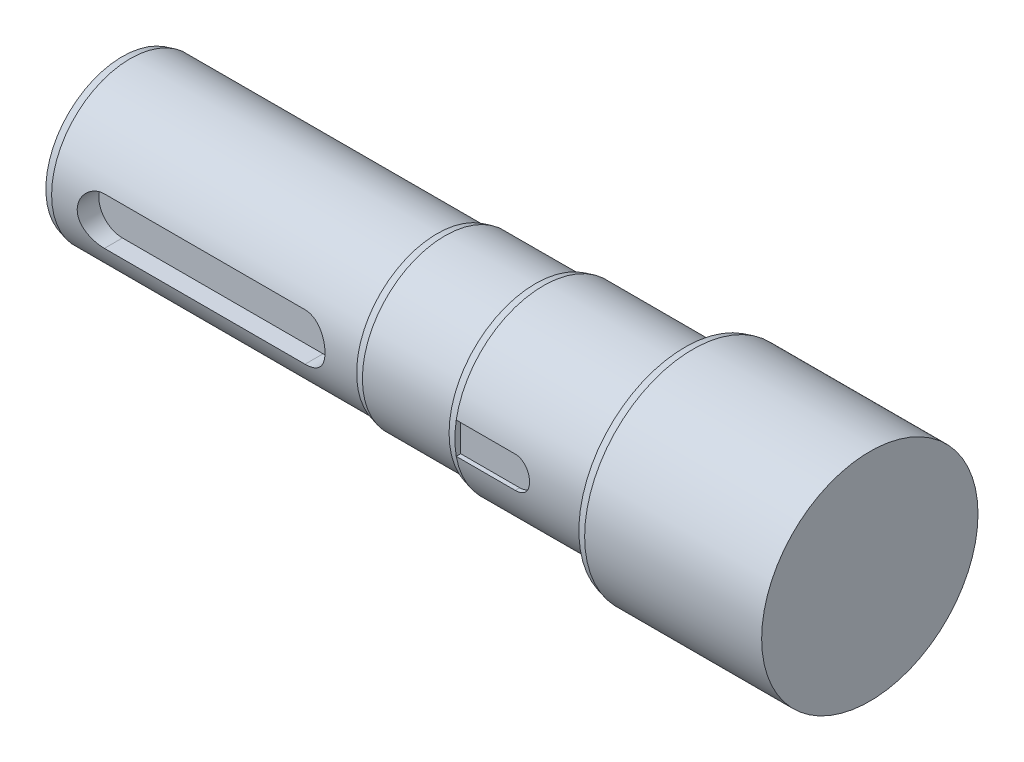
ISO-10303-21;
HEADER;
FILE_DESCRIPTION(('STEP AP214'),'2;1');
FILE_NAME('part.step','',(''),(''),'','','');
FILE_SCHEMA(('AUTOMOTIVE_DESIGN { 1 0 10303 214 1 1 1 1 }'));
ENDSEC;
DATA;
#1=APPLICATION_CONTEXT('core data for automotive mechanical design processes');
#2=APPLICATION_PROTOCOL_DEFINITION('international standard','automotive_design',2000,#1);
#3=PRODUCT_CONTEXT('',#1,'mechanical');
#4=PRODUCT('Part','Part','',(#3));
#5=PRODUCT_RELATED_PRODUCT_CATEGORY('part','',(#4));
#6=PRODUCT_DEFINITION_FORMATION('','',#4);
#7=PRODUCT_DEFINITION_CONTEXT('part definition',#1,'design');
#8=PRODUCT_DEFINITION('design','',#6,#7);
#9=PRODUCT_DEFINITION_SHAPE('','',#8);
#10=(LENGTH_UNIT() NAMED_UNIT(*) SI_UNIT(.MILLI.,.METRE.));
#11=(NAMED_UNIT(*) PLANE_ANGLE_UNIT() SI_UNIT($,.RADIAN.));
#12=(NAMED_UNIT(*) SI_UNIT($,.STERADIAN.) SOLID_ANGLE_UNIT());
#13=UNCERTAINTY_MEASURE_WITH_UNIT(LENGTH_MEASURE(1.E-05),#10,'distance_accuracy_value','');
#14=(GEOMETRIC_REPRESENTATION_CONTEXT(3) GLOBAL_UNCERTAINTY_ASSIGNED_CONTEXT((#13)) GLOBAL_UNIT_ASSIGNED_CONTEXT((#10,
#11,#12)) REPRESENTATION_CONTEXT('',''));
#15=CARTESIAN_POINT('',(0.,0.,0.));
#16=DIRECTION('',(0.,0.,1.));
#17=DIRECTION('',(1.,0.,0.));
#18=AXIS2_PLACEMENT_3D('',#15,#16,#17);
#19=CARTESIAN_POINT('',(-47.,27.5,0.));
#20=DIRECTION('',(1.,0.,0.));
#21=DIRECTION('',(0.,0.,-1.));
#22=AXIS2_PLACEMENT_3D('',#19,#20,#21);
#23=PLANE('',#22);
#24=CARTESIAN_POINT('',(-47.,0.,0.));
#25=DIRECTION('',(1.,0.,0.));
#26=DIRECTION('',(0.,0.,-1.));
#27=AXIS2_PLACEMENT_3D('',#24,#25,#26);
#28=CIRCLE('',#27,26.9641016151378);
#29=CARTESIAN_POINT('',(-47.,0.,-26.9641016151378));
#30=VERTEX_POINT('',#29);
#31=EDGE_CURVE('E204',#30,#30,#28,.F.);
#32=ORIENTED_EDGE('',*,*,#31,.T.);
#33=EDGE_LOOP('',(#32));
#34=FACE_BOUND('',#33,.T.);
#35=CARTESIAN_POINT('',(-47.,0.,0.));
#36=DIRECTION('',(-1.,0.,0.));
#37=DIRECTION('',(0.,0.,1.));
#38=AXIS2_PLACEMENT_3D('',#35,#36,#37);
#39=CIRCLE('',#38,22.5);
#40=CARTESIAN_POINT('',(-47.,0.,22.5));
#41=VERTEX_POINT('',#40);
#42=EDGE_CURVE('E195',#41,#41,#39,.T.);
#43=ORIENTED_EDGE('',*,*,#42,.F.);
#44=EDGE_LOOP('',(#43));
#45=FACE_BOUND('',#44,.T.);
#46=ADVANCED_FACE('F39',(#34,#45),#23,.F.);
#47=CARTESIAN_POINT('',(-55.0769282450954,0.,0.));
#48=DIRECTION('',(-1.,0.,0.));
#49=DIRECTION('',(0.,0.,1.));
#50=AXIS2_PLACEMENT_3D('',#47,#48,#49);
#51=CYLINDRICAL_SURFACE('',#50,27.5);
#52=CARTESIAN_POINT('',(-45.0000000000002,0.,0.));
#53=DIRECTION('',(1.,0.,0.));
#54=DIRECTION('',(0.,0.,-1.));
#55=AXIS2_PLACEMENT_3D('',#52,#53,#54);
#56=CIRCLE('',#55,27.5);
#57=CARTESIAN_POINT('',(-45.0000000000002,0.,-27.5));
#58=VERTEX_POINT('',#57);
#59=EDGE_CURVE('E207',#58,#58,#56,.T.);
#60=ORIENTED_EDGE('',*,*,#59,.T.);
#61=EDGE_LOOP('',(#60));
#62=FACE_BOUND('',#61,.T.);
#63=CARTESIAN_POINT('',(0.,0.,0.));
#64=DIRECTION('',(-1.,0.,0.));
#65=DIRECTION('',(0.,0.,1.));
#66=AXIS2_PLACEMENT_3D('',#63,#64,#65);
#67=CIRCLE('',#66,27.5);
#68=CARTESIAN_POINT('',(0.,0.,27.5));
#69=VERTEX_POINT('',#68);
#70=EDGE_CURVE('E192',#69,#69,#67,.T.);
#71=ORIENTED_EDGE('',*,*,#70,.T.);
#72=EDGE_LOOP('',(#71));
#73=FACE_BOUND('',#72,.T.);
#74=ADVANCED_FACE('F271',(#62,#73),#51,.T.);
#75=CARTESIAN_POINT('',(0.,0.,0.));
#76=DIRECTION('',(-1.,0.,0.));
#77=DIRECTION('',(0.,0.,1.));
#78=AXIS2_PLACEMENT_3D('',#75,#76,#77);
#79=PLANE('',#78);
#80=ORIENTED_EDGE('',*,*,#70,.F.);
#81=EDGE_LOOP('',(#80));
#82=FACE_BOUND('',#81,.T.);
#83=ADVANCED_FACE('F277',(#82),#79,.F.);
#84=CARTESIAN_POINT('',(-190.,20.,0.));
#85=DIRECTION('',(1.,0.,0.));
#86=DIRECTION('',(0.,0.,-1.));
#87=AXIS2_PLACEMENT_3D('',#84,#85,#86);
#88=PLANE('',#87);
#89=CARTESIAN_POINT('',(-190.,0.,0.));
#90=DIRECTION('',(1.,0.,0.));
#91=DIRECTION('',(0.,0.,-1.));
#92=AXIS2_PLACEMENT_3D('',#89,#90,#91);
#93=CIRCLE('',#92,19.4641016151377);
#94=CARTESIAN_POINT('',(-190.,0.,-19.4641016151377));
#95=VERTEX_POINT('',#94);
#96=EDGE_CURVE('E346',#95,#95,#93,.F.);
#97=ORIENTED_EDGE('',*,*,#96,.T.);
#98=EDGE_LOOP('',(#97));
#99=FACE_BOUND('',#98,.T.);
#100=CARTESIAN_POINT('',(-190.,10.,0.));
#101=DIRECTION('',(-1.,0.,0.));
#102=DIRECTION('',(0.,0.,1.));
#103=AXIS2_PLACEMENT_3D('',#100,#101,#102);
#104=CIRCLE('',#103,3.4);
#105=CARTESIAN_POINT('',(-190.,10.,3.4));
#106=VERTEX_POINT('',#105);
#107=EDGE_CURVE('E152',#106,#106,#104,.T.);
#108=ORIENTED_EDGE('',*,*,#107,.F.);
#109=EDGE_LOOP('',(#108));
#110=FACE_BOUND('',#109,.T.);
#111=CARTESIAN_POINT('',(-190.,-10.,0.));
#112=DIRECTION('',(-1.,0.,0.));
#113=DIRECTION('',(0.,0.,1.));
#114=AXIS2_PLACEMENT_3D('',#111,#112,#113);
#115=CIRCLE('',#114,3.4);
#116=CARTESIAN_POINT('',(-190.,-10.,3.4));
#117=VERTEX_POINT('',#116);
#118=EDGE_CURVE('E158',#117,#117,#115,.T.);
#119=ORIENTED_EDGE('',*,*,#118,.F.);
#120=EDGE_LOOP('',(#119));
#121=FACE_BOUND('',#120,.T.);
#122=ADVANCED_FACE('F267',(#99,#110,#121),#88,.F.);
#123=CARTESIAN_POINT('',(-55.0769282450954,0.,0.));
#124=DIRECTION('',(-1.,0.,0.));
#125=DIRECTION('',(0.,0.,1.));
#126=AXIS2_PLACEMENT_3D('',#123,#124,#125);
#127=CYLINDRICAL_SURFACE('',#126,20.);
#128=CARTESIAN_POINT('',(-188.,0.,0.));
#129=DIRECTION('',(1.,0.,0.));
#130=DIRECTION('',(0.,0.,-1.));
#131=AXIS2_PLACEMENT_3D('',#128,#129,#130);
#132=CIRCLE('',#131,20.);
#133=CARTESIAN_POINT('',(-188.,0.,-20.));
#134=VERTEX_POINT('',#133);
#135=EDGE_CURVE('E52',#134,#134,#132,.T.);
#136=ORIENTED_EDGE('',*,*,#135,.T.);
#137=EDGE_LOOP('',(#136));
#138=FACE_BOUND('',#137,.T.);
#139=DIRECTION('',(-1.,0.,0.));
#140=VECTOR('',#139,1.);
#141=CARTESIAN_POINT('',(-55.0769282450954,6.,19.0787840283389));
#142=LINE('',#141,#140);
#143=CARTESIAN_POINT('',(-175.5,6.,19.0787840283389));
#144=VERTEX_POINT('',#143);
#145=CARTESIAN_POINT('',(-124.5,6.,19.0787840283389));
#146=VERTEX_POINT('',#145);
#147=EDGE_CURVE('E344',#144,#146,#142,.F.);
#148=ORIENTED_EDGE('',*,*,#147,.T.);
#149=CARTESIAN_POINT('',(-124.5,6.,19.0787840283389));
#150=CARTESIAN_POINT('',(-124.335332005089,6.00002230630953,19.0787603919218));
#151=CARTESIAN_POINT('',(-124.17067261307,5.99322212828861,19.0809150948053));
#152=CARTESIAN_POINT('',(-123.842610571615,5.96614198358438,19.089408588524));
#153=CARTESIAN_POINT('',(-123.679207647986,5.94586504749982,19.0957464386677));
#154=CARTESIAN_POINT('',(-123.355233206316,5.89206455668659,19.1124126760414));
#155=CARTESIAN_POINT('',(-123.194655572036,5.85857463708937,19.1227309292375));
#156=CARTESIAN_POINT('',(-122.877037691332,5.77865096251378,19.1470349488515));
#157=CARTESIAN_POINT('',(-122.719997537531,5.73221686903431,19.1610208111801));
#158=CARTESIAN_POINT('',(-122.410617439276,5.62682620459484,19.1922338155173));
#159=CARTESIAN_POINT('',(-122.258274781224,5.56787702452553,19.2094590438082));
#160=CARTESIAN_POINT('',(-121.959125857098,5.43788252899624,19.2466621419291));
#161=CARTESIAN_POINT('',(-121.812321675672,5.36683271334057,19.2666410353108));
#162=CARTESIAN_POINT('',(-121.525215054747,5.21317247195195,19.3087849542851));
#163=CARTESIAN_POINT('',(-121.38491298147,5.13056139609833,19.3309501027959));
#164=CARTESIAN_POINT('',(-121.111612201325,4.95431913401973,19.3768680311909));
#165=CARTESIAN_POINT('',(-120.978616283128,4.86068378223771,19.4006214097184));
#166=CARTESIAN_POINT('',(-120.71713642677,4.66024014290223,19.4497584548899));
#167=CARTESIAN_POINT('',(-120.588884847802,4.5531352636269,19.4751691904069));
#168=CARTESIAN_POINT('',(-120.341746062991,4.32860344600267,19.5263015189751));
#169=CARTESIAN_POINT('',(-120.222862133329,4.21117292654719,19.5520232171847));
#170=CARTESIAN_POINT('',(-119.995258604878,3.96676059198592,19.6030710031715));
#171=CARTESIAN_POINT('',(-119.886539067971,3.83977871873939,19.6283970885393));
#172=CARTESIAN_POINT('',(-119.679980745528,3.57705696576212,19.6779706962222));
#173=CARTESIAN_POINT('',(-119.582141874161,3.4413171551297,19.7022182270443));
#174=CARTESIAN_POINT('',(-119.39609023174,3.15899953964078,19.7494715734221));
#175=CARTESIAN_POINT('',(-119.308121953698,3.01225429870655,19.7724407517412));
#176=CARTESIAN_POINT('',(-119.144936205945,2.71155717798054,19.8159158974823));
#177=CARTESIAN_POINT('',(-119.069714021433,2.55760798995098,19.8364227748921));
#178=CARTESIAN_POINT('',(-118.932583560629,2.24348996032483,19.8744001644265));
#179=CARTESIAN_POINT('',(-118.870677745232,2.0833199755562,19.8918701152059));
#180=CARTESIAN_POINT('',(-118.760762497544,1.75801430484774,19.923254535561));
#181=CARTESIAN_POINT('',(-118.712747060032,1.5928807989739,19.9371705413065));
#182=CARTESIAN_POINT('',(-118.632174453272,1.26354510595576,19.960709769643));
#183=CARTESIAN_POINT('',(-118.599219373042,1.0994480892508,19.9704430293701));
#184=CARTESIAN_POINT('',(-118.547128002714,0.768952154148964,19.9858966495547));
#185=CARTESIAN_POINT('',(-118.527986195865,0.60255418179931,19.9916186120195));
#186=CARTESIAN_POINT('',(-118.503680035143,0.268644299740245,19.9988929276978));
#187=CARTESIAN_POINT('',(-118.498516105694,0.101132356360991,20.0004451543012));
#188=CARTESIAN_POINT('',(-118.502216405078,-0.233720900410844,19.9993350985708));
#189=CARTESIAN_POINT('',(-118.511080376463,-0.401062216878487,19.9966728935831));
#190=CARTESIAN_POINT('',(-118.542242211602,-0.728949940400293,19.9873626800314));
#191=CARTESIAN_POINT('',(-118.564100009983,-0.889542117296638,19.9808452710305));
#192=CARTESIAN_POINT('',(-118.620695481758,-1.20830021014904,19.9641050678088));
#193=CARTESIAN_POINT('',(-118.655437542225,-1.36646528055413,19.9538810115069));
#194=CARTESIAN_POINT('',(-118.73749230161,-1.67917461818936,19.9300014175933));
#195=CARTESIAN_POINT('',(-118.784800775723,-1.8337200833573,19.9163470333349));
#196=CARTESIAN_POINT('',(-118.891630271063,-2.13828018933733,19.885954581515));
#197=CARTESIAN_POINT('',(-118.951155883997,-2.28829310223868,19.8692153547842));
#198=CARTESIAN_POINT('',(-119.082690579539,-2.5844350788094,19.8328818557961));
#199=CARTESIAN_POINT('',(-119.154832897198,-2.73050124822118,19.8132575095082));
#200=CARTESIAN_POINT('',(-119.310623147329,-3.01609632375419,19.7717979578185));
#201=CARTESIAN_POINT('',(-119.394275028384,-3.15562296424239,19.7499619943591));
#202=CARTESIAN_POINT('',(-119.572486982441,-3.42724384686889,19.704643118031));
#203=CARTESIAN_POINT('',(-119.667047181428,-3.55933800314025,19.681160186142));
#204=CARTESIAN_POINT('',(-119.866458678429,-3.81531376455354,19.6331439703208));
#205=CARTESIAN_POINT('',(-119.971310276501,-3.93919513006482,19.6086106557752));
#206=CARTESIAN_POINT('',(-120.194897243463,-4.1826365359165,19.5581593507452));
#207=CARTESIAN_POINT('',(-120.314012679474,-4.30184428600932,19.5322244988475));
#208=CARTESIAN_POINT('',(-120.561833503502,-4.52981041510265,19.4806179410542));
#209=CARTESIAN_POINT('',(-120.690535796081,-4.63857214120814,19.454946153239));
#210=CARTESIAN_POINT('',(-120.956840396238,-4.84504126060964,19.4045581786367));
#211=CARTESIAN_POINT('',(-121.094448571901,-4.94274124635231,19.3798426394128));
#212=CARTESIAN_POINT('',(-121.377559092333,-5.12628631686322,19.3321023379674));
#213=CARTESIAN_POINT('',(-121.523058337578,-5.21213600998875,19.3090769201297));
#214=CARTESIAN_POINT('',(-121.822635135093,-5.37223080367564,19.2651525602885));
#215=CARTESIAN_POINT('',(-121.976787078659,-5.446343714374,19.2442786555291));
#216=CARTESIAN_POINT('',(-122.291121841361,-5.58122691640502,19.2055937237889));
#217=CARTESIAN_POINT('',(-122.451302162478,-5.64200266456202,19.1877814448102));
#218=CARTESIAN_POINT('',(-122.77643211835,-5.7496614534963,19.1557967477957));
#219=CARTESIAN_POINT('',(-122.941376526563,-5.79655912825486,19.1416204978023));
#220=CARTESIAN_POINT('',(-123.274893180451,-5.87609462586437,19.1173543231182));
#221=CARTESIAN_POINT('',(-123.443463715048,-5.90873902604376,19.1072625137754));
#222=CARTESIAN_POINT('',(-123.759937070236,-5.956031317324,19.0925703406668));
#223=CARTESIAN_POINT('',(-123.90754170936,-5.97251971262424,19.0874107715083));
#224=CARTESIAN_POINT('',(-124.203427112475,-5.99450261914155,19.0805126306352));
#225=CARTESIAN_POINT('',(-124.351706559575,-6.00001329545507,19.0787690288453));
#226=CARTESIAN_POINT('',(-124.5,-5.99999999999999,19.0787840283389));
#227=B_SPLINE_CURVE_WITH_KNOTS('',3,(#149,#150,#151,#152,#153,#154,#155,#156,#157,#158,#159,
#160,#161,#162,#163,#164,#165,#166,#167,#168,#169,#170,#171,#172,#173,#174,#175,#176,#177,#178,
#179,#180,#181,#182,#183,#184,#185,#186,#187,#188,#189,#190,#191,#192,#193,#194,#195,#196,#197,
#198,#199,#200,#201,#202,#203,#204,#205,#206,#207,#208,#209,#210,#211,#212,#213,#214,#215,#216,
#217,#218,#219,#220,#221,#222,#223,#224,#225,#226),.UNSPECIFIED.,.F.,.F.,(4,2,2,2,2,2,2,2,2,2,2,
2,2,2,2,2,2,2,2,2,2,2,2,2,2,2,2,2,2,2,2,2,2,2,2,2,2,2,4),(0.,0.493836284878934,
0.987561555412173,1.48003801924601,1.97252736296404,2.4647266679518,2.95710942192586,
3.44951987503681,3.94211698773,4.4485789847459,4.95521732942465,5.46185875834844,
5.96849619046392,6.48574341264192,7.00279888450883,7.51994982748058,8.03687685551442,
8.53921958328376,9.04136157401787,9.54351881163818,10.0456668334346,10.5317065218739,
11.0179118582603,11.5039539397551,11.9901790315928,12.4818885441265,12.9737671698834,
13.4656514771114,13.9575501300996,14.4684682486942,14.9792221093922,15.4903160010786,
16.001210574562,16.517502934493,17.0335836608614,17.549118241575,18.0644146711719,
18.509813123396,18.9545552237083),.UNSPECIFIED.);
#228=CARTESIAN_POINT('',(-124.5,-5.99999999999999,19.0787840283389));
#229=VERTEX_POINT('',#228);
#230=EDGE_CURVE('E215',#146,#229,#227,.T.);
#231=ORIENTED_EDGE('',*,*,#230,.T.);
#232=DIRECTION('',(-1.,0.,0.));
#233=VECTOR('',#232,1.);
#234=CARTESIAN_POINT('',(-55.0769282450954,-5.99999999999998,19.0787840283389));
#235=LINE('',#234,#233);
#236=CARTESIAN_POINT('',(-175.5,-5.99999999999998,19.0787840283389));
#237=VERTEX_POINT('',#236);
#238=EDGE_CURVE('E341',#229,#237,#235,.T.);
#239=ORIENTED_EDGE('',*,*,#238,.T.);
#240=CARTESIAN_POINT('',(-175.5,-6.,19.0787840283389));
#241=CARTESIAN_POINT('',(-175.664667994911,-6.00002230630953,19.0787603919218));
#242=CARTESIAN_POINT('',(-175.82932738693,-5.99322212828861,19.0809150948053));
#243=CARTESIAN_POINT('',(-176.157389428385,-5.96614198358438,19.089408588524));
#244=CARTESIAN_POINT('',(-176.320792352014,-5.94586504749982,19.0957464386677));
#245=CARTESIAN_POINT('',(-176.644766793684,-5.89206455668659,19.1124126760414));
#246=CARTESIAN_POINT('',(-176.805344427964,-5.85857463708937,19.1227309292375));
#247=CARTESIAN_POINT('',(-177.122962308668,-5.77865096251378,19.1470349488515));
#248=CARTESIAN_POINT('',(-177.280002462469,-5.73221686903431,19.1610208111801));
#249=CARTESIAN_POINT('',(-177.589382560724,-5.62682620459483,19.1922338155173));
#250=CARTESIAN_POINT('',(-177.741725218776,-5.56787702452553,19.2094590438082));
#251=CARTESIAN_POINT('',(-178.040874142902,-5.43788252899625,19.2466621419291));
#252=CARTESIAN_POINT('',(-178.187678324328,-5.36683271334057,19.2666410353108));
#253=CARTESIAN_POINT('',(-178.474784945253,-5.21317247195195,19.3087849542851));
#254=CARTESIAN_POINT('',(-178.61508701853,-5.13056139609833,19.3309501027959));
#255=CARTESIAN_POINT('',(-178.888387798675,-4.95431913401974,19.3768680311909));
#256=CARTESIAN_POINT('',(-179.021383716872,-4.86068378223772,19.4006214097184));
#257=CARTESIAN_POINT('',(-179.28286357323,-4.66024014290223,19.4497584548899));
#258=CARTESIAN_POINT('',(-179.411115152198,-4.55313526362689,19.4751691904069));
#259=CARTESIAN_POINT('',(-179.658253937009,-4.32860344600265,19.5263015189751));
#260=CARTESIAN_POINT('',(-179.777137866671,-4.21117292654718,19.5520232171847));
#261=CARTESIAN_POINT('',(-180.004741395122,-3.96676059198591,19.6030710031715));
#262=CARTESIAN_POINT('',(-180.113460932029,-3.83977871873937,19.6283970885393));
#263=CARTESIAN_POINT('',(-180.320019254472,-3.57705696576209,19.6779706962222));
#264=CARTESIAN_POINT('',(-180.417858125839,-3.44131715512968,19.7022182270443));
#265=CARTESIAN_POINT('',(-180.60390976826,-3.15899953964076,19.7494715734221));
#266=CARTESIAN_POINT('',(-180.691878046302,-3.01225429870653,19.7724407517412));
#267=CARTESIAN_POINT('',(-180.855063794055,-2.71155717798051,19.8159158974823));
#268=CARTESIAN_POINT('',(-180.930285978567,-2.55760798995095,19.8364227748921));
#269=CARTESIAN_POINT('',(-181.067416439371,-2.2434899603248,19.8744001644265));
#270=CARTESIAN_POINT('',(-181.129322254768,-2.08331997555618,19.8918701152059));
#271=CARTESIAN_POINT('',(-181.239237502456,-1.75801430484772,19.923254535561));
#272=CARTESIAN_POINT('',(-181.287252939968,-1.59288079897389,19.9371705413065));
#273=CARTESIAN_POINT('',(-181.367825546728,-1.26354510595574,19.960709769643));
#274=CARTESIAN_POINT('',(-181.400780626958,-1.09944808925078,19.9704430293701));
#275=CARTESIAN_POINT('',(-181.452871997286,-0.768952154148943,19.9858966495547));
#276=CARTESIAN_POINT('',(-181.472013804135,-0.602554181799289,19.9916186120195));
#277=CARTESIAN_POINT('',(-181.496319964857,-0.268644299740224,19.9988929276978));
#278=CARTESIAN_POINT('',(-181.501483894306,-0.10113235636097,20.0004451543012));
#279=CARTESIAN_POINT('',(-181.497783594921,0.233720900410867,19.9993350985708));
#280=CARTESIAN_POINT('',(-181.488919623537,0.401062216878509,19.9966728935831));
#281=CARTESIAN_POINT('',(-181.457757788398,0.728949940400315,19.9873626800314));
#282=CARTESIAN_POINT('',(-181.435899990017,0.889542117296661,19.9808452710305));
#283=CARTESIAN_POINT('',(-181.379304518242,1.20830021014907,19.9641050678088));
#284=CARTESIAN_POINT('',(-181.344562457775,1.36646528055415,19.9538810115069));
#285=CARTESIAN_POINT('',(-181.26250769839,1.67917461818939,19.9300014175933));
#286=CARTESIAN_POINT('',(-181.215199224277,1.83372008335732,19.9163470333349));
#287=CARTESIAN_POINT('',(-181.108369728937,2.13828018933735,19.885954581515));
#288=CARTESIAN_POINT('',(-181.048844116003,2.28829310223871,19.8692153547842));
#289=CARTESIAN_POINT('',(-180.917309420461,2.58443507880942,19.8328818557961));
#290=CARTESIAN_POINT('',(-180.845167102802,2.7305012482212,19.8132575095082));
#291=CARTESIAN_POINT('',(-180.689376852671,3.0160963237542,19.7717979578185));
#292=CARTESIAN_POINT('',(-180.605724971616,3.1556229642424,19.7499619943591));
#293=CARTESIAN_POINT('',(-180.427513017559,3.42724384686891,19.704643118031));
#294=CARTESIAN_POINT('',(-180.332952818572,3.55933800314026,19.681160186142));
#295=CARTESIAN_POINT('',(-180.133541321571,3.81531376455356,19.6331439703208));
#296=CARTESIAN_POINT('',(-180.028689723499,3.93919513006484,19.6086106557752));
#297=CARTESIAN_POINT('',(-179.805102756537,4.18263653591652,19.5581593507451));
#298=CARTESIAN_POINT('',(-179.685987320526,4.30184428600933,19.5322244988474));
#299=CARTESIAN_POINT('',(-179.438166496498,4.52981041510266,19.4806179410542));
#300=CARTESIAN_POINT('',(-179.309464203919,4.63857214120815,19.454946153239));
#301=CARTESIAN_POINT('',(-179.043159603762,4.84504126060965,19.4045581786367));
#302=CARTESIAN_POINT('',(-178.905551428099,4.94274124635231,19.3798426394128));
#303=CARTESIAN_POINT('',(-178.622440907667,5.12628631686323,19.3321023379674));
#304=CARTESIAN_POINT('',(-178.476941662422,5.21213600998878,19.3090769201297));
#305=CARTESIAN_POINT('',(-178.177364864907,5.37223080367567,19.2651525602885));
#306=CARTESIAN_POINT('',(-178.023212921341,5.44634371437402,19.2442786555291));
#307=CARTESIAN_POINT('',(-177.708878158639,5.58122691640503,19.2055937237889));
#308=CARTESIAN_POINT('',(-177.548697837522,5.64200266456204,19.1877814448102));
#309=CARTESIAN_POINT('',(-177.22356788165,5.74966145349632,19.1557967477956));
#310=CARTESIAN_POINT('',(-177.058623473437,5.79655912825488,19.1416204978023));
#311=CARTESIAN_POINT('',(-176.725106819549,5.87609462586438,19.1173543231182));
#312=CARTESIAN_POINT('',(-176.556536284951,5.90873902604377,19.1072625137754));
#313=CARTESIAN_POINT('',(-176.240062929764,5.95603131732401,19.0925703406668));
#314=CARTESIAN_POINT('',(-176.09245829064,5.97251971262425,19.0874107715083));
#315=CARTESIAN_POINT('',(-175.796572887525,5.99450261914155,19.0805126306352));
#316=CARTESIAN_POINT('',(-175.648293440425,6.00001329545508,19.0787690288453));
#317=CARTESIAN_POINT('',(-175.5,6.,19.0787840283389));
#318=B_SPLINE_CURVE_WITH_KNOTS('',3,(#240,#241,#242,#243,#244,#245,#246,#247,#248,#249,#250,
#251,#252,#253,#254,#255,#256,#257,#258,#259,#260,#261,#262,#263,#264,#265,#266,#267,#268,#269,
#270,#271,#272,#273,#274,#275,#276,#277,#278,#279,#280,#281,#282,#283,#284,#285,#286,#287,#288,
#289,#290,#291,#292,#293,#294,#295,#296,#297,#298,#299,#300,#301,#302,#303,#304,#305,#306,#307,
#308,#309,#310,#311,#312,#313,#314,#315,#316,#317),.UNSPECIFIED.,.F.,.F.,(4,2,2,2,2,2,2,2,2,2,2,
2,2,2,2,2,2,2,2,2,2,2,2,2,2,2,2,2,2,2,2,2,2,2,2,2,2,2,4),(0.,0.493836284878976,
0.987561555412188,1.48003801924603,1.97252736296405,2.46472666795181,2.95710942192586,
3.44951987503682,3.94211698773,4.44857898474593,4.95521732942468,5.46185875834849,
5.96849619046396,6.48574341264194,7.00279888450885,7.5199498274806,8.03687685551445,
8.53921958328379,9.04136157401789,9.54351881163821,10.0456668334346,10.531706521874,
11.0179118582603,11.5039539397552,11.9901790315928,12.4818885441265,12.9737671698834,
13.4656514771114,13.9575501300996,14.4684682486943,14.9792221093922,15.4903160010786,
16.001210574562,16.5175029344931,17.0335836608614,17.5491182415751,18.0644146711719,
18.509813123396,18.9545552237083),.UNSPECIFIED.);
#319=EDGE_CURVE('E67',#237,#144,#318,.T.);
#320=ORIENTED_EDGE('',*,*,#319,.T.);
#321=EDGE_LOOP('',(#148,#231,#239,#320));
#322=FACE_BOUND('',#321,.T.);
#323=CARTESIAN_POINT('',(-110.,0.,0.));
#324=DIRECTION('',(-1.,0.,0.));
#325=DIRECTION('',(0.,0.,1.));
#326=AXIS2_PLACEMENT_3D('',#323,#324,#325);
#327=CIRCLE('',#326,20.);
#328=CARTESIAN_POINT('',(-110.,0.,20.));
#329=VERTEX_POINT('',#328);
#330=EDGE_CURVE('E189',#329,#329,#327,.T.);
#331=ORIENTED_EDGE('',*,*,#330,.T.);
#332=EDGE_LOOP('',(#331));
#333=FACE_BOUND('',#332,.T.);
#334=ADVANCED_FACE('F228',(#138,#322,#333),#127,.T.);
#335=CARTESIAN_POINT('',(-110.,20.,0.));
#336=DIRECTION('',(1.,0.,0.));
#337=DIRECTION('',(0.,0.,-1.));
#338=AXIS2_PLACEMENT_3D('',#335,#336,#337);
#339=PLANE('',#338);
#340=CARTESIAN_POINT('',(-110.,0.,0.));
#341=DIRECTION('',(1.,0.,0.));
#342=DIRECTION('',(0.,0.,-1.));
#343=AXIS2_PLACEMENT_3D('',#340,#341,#342);
#344=CIRCLE('',#343,20.4641016151377);
#345=CARTESIAN_POINT('',(-110.,0.,-20.4641016151377));
#346=VERTEX_POINT('',#345);
#347=EDGE_CURVE('E198',#346,#346,#344,.F.);
#348=ORIENTED_EDGE('',*,*,#347,.T.);
#349=EDGE_LOOP('',(#348));
#350=FACE_BOUND('',#349,.T.);
#351=ORIENTED_EDGE('',*,*,#330,.F.);
#352=EDGE_LOOP('',(#351));
#353=FACE_BOUND('',#352,.T.);
#354=ADVANCED_FACE('F260',(#350,#353),#339,.F.);
#355=CARTESIAN_POINT('',(-55.0769282450954,0.,0.));
#356=DIRECTION('',(-1.,0.,0.));
#357=DIRECTION('',(0.,0.,1.));
#358=AXIS2_PLACEMENT_3D('',#355,#356,#357);
#359=CYLINDRICAL_SURFACE('',#358,21.);
#360=CARTESIAN_POINT('',(-108.,0.,0.));
#361=DIRECTION('',(1.,0.,0.));
#362=DIRECTION('',(0.,0.,-1.));
#363=AXIS2_PLACEMENT_3D('',#360,#361,#362);
#364=CIRCLE('',#363,21.);
#365=CARTESIAN_POINT('',(-108.,0.,-21.));
#366=VERTEX_POINT('',#365);
#367=EDGE_CURVE('E201',#366,#366,#364,.T.);
#368=ORIENTED_EDGE('',*,*,#367,.T.);
#369=EDGE_LOOP('',(#368));
#370=FACE_BOUND('',#369,.T.);
#371=CARTESIAN_POINT('',(-85.,0.,0.));
#372=DIRECTION('',(-1.,0.,0.));
#373=DIRECTION('',(0.,0.,1.));
#374=AXIS2_PLACEMENT_3D('',#371,#372,#373);
#375=CIRCLE('',#374,21.);
#376=CARTESIAN_POINT('',(-85.,0.,21.));
#377=VERTEX_POINT('',#376);
#378=EDGE_CURVE('E179',#377,#377,#375,.T.);
#379=ORIENTED_EDGE('',*,*,#378,.T.);
#380=EDGE_LOOP('',(#379));
#381=FACE_BOUND('',#380,.T.);
#382=ADVANCED_FACE('F257',(#370,#381),#359,.T.);
#383=CARTESIAN_POINT('',(-85.,21.,0.));
#384=DIRECTION('',(1.,0.,0.));
#385=DIRECTION('',(0.,0.,-1.));
#386=AXIS2_PLACEMENT_3D('',#383,#384,#385);
#387=PLANE('',#386);
#388=CARTESIAN_POINT('',(-85.,0.,0.));
#389=DIRECTION('',(1.,0.,0.));
#390=DIRECTION('',(0.,0.,-1.));
#391=AXIS2_PLACEMENT_3D('',#388,#389,#390);
#392=CIRCLE('',#391,21.9641016151377);
#393=CARTESIAN_POINT('',(-85.,0.,-21.9641016151377));
#394=VERTEX_POINT('',#393);
#395=EDGE_CURVE('E210',#394,#394,#392,.F.);
#396=ORIENTED_EDGE('',*,*,#395,.T.);
#397=EDGE_LOOP('',(#396));
#398=FACE_BOUND('',#397,.T.);
#399=ORIENTED_EDGE('',*,*,#378,.F.);
#400=EDGE_LOOP('',(#399));
#401=FACE_BOUND('',#400,.T.);
#402=ADVANCED_FACE('F253',(#398,#401),#387,.F.);
#403=CARTESIAN_POINT('',(-55.0769282450954,0.,0.));
#404=DIRECTION('',(-1.,0.,0.));
#405=DIRECTION('',(0.,0.,1.));
#406=AXIS2_PLACEMENT_3D('',#403,#404,#405);
#407=CYLINDRICAL_SURFACE('',#406,22.5);
#408=CARTESIAN_POINT('',(-82.9999999999998,0.,0.));
#409=DIRECTION('',(1.,0.,0.));
#410=DIRECTION('',(0.,0.,-1.));
#411=AXIS2_PLACEMENT_3D('',#408,#409,#410);
#412=CIRCLE('',#411,22.5);
#413=CARTESIAN_POINT('',(-82.9999999999998,-4.00000000000001,22.1415898254845));
#414=VERTEX_POINT('',#413);
#415=CARTESIAN_POINT('',(-82.9999999999998,4.,22.1415898254845));
#416=VERTEX_POINT('',#415);
#417=EDGE_CURVE('E213',#414,#416,#412,.T.);
#418=ORIENTED_EDGE('',*,*,#417,.T.);
#419=DIRECTION('',(-1.,0.,0.));
#420=VECTOR('',#419,1.);
#421=CARTESIAN_POINT('',(-55.0769282450954,4.,22.1415898254845));
#422=LINE('',#421,#420);
#423=CARTESIAN_POINT('',(-67.9999999999998,4.,22.1415898254845));
#424=VERTEX_POINT('',#423);
#425=EDGE_CURVE('E149',#416,#424,#422,.F.);
#426=ORIENTED_EDGE('',*,*,#425,.T.);
#427=CARTESIAN_POINT('',(-67.9999999999998,4.,22.1415898254845));
#428=CARTESIAN_POINT('',(-67.8884443157555,4.00001181100801,22.1415813332223));
#429=CARTESIAN_POINT('',(-67.7768949708915,3.99533336555647,22.1424327158618));
#430=CARTESIAN_POINT('',(-67.5546120835114,3.97668753174213,22.1457923878102));
#431=CARTESIAN_POINT('',(-67.4438784546347,3.96272114141922,22.1483004990943));
#432=CARTESIAN_POINT('',(-67.2241541353541,3.92561599891462,22.1549063510913));
#433=CARTESIAN_POINT('',(-67.115161294989,3.90248964726233,22.1590019425529));
#434=CARTESIAN_POINT('',(-66.8995702936997,3.84726578985144,22.1686563609308));
#435=CARTESIAN_POINT('',(-66.7929721341574,3.81516827891658,22.1742151886914));
#436=CARTESIAN_POINT('',(-66.4778519529334,3.70572537061617,22.1928628154685));
#437=CARTESIAN_POINT('',(-66.2738474717948,3.6152029334267,22.2079278079655));
#438=CARTESIAN_POINT('',(-65.8840209139626,3.40177823127076,22.2416163441149));
#439=CARTESIAN_POINT('',(-65.6981995920981,3.27887462286084,22.2602400354031));
#440=CARTESIAN_POINT('',(-65.347821879211,3.002693725567,22.2991798442776));
#441=CARTESIAN_POINT('',(-65.1834946144048,2.84912734508846,22.3195109123207));
#442=CARTESIAN_POINT('',(-64.8827880882652,2.51659712051369,22.3594438756203));
#443=CARTESIAN_POINT('',(-64.7464131235182,2.33762937908424,22.3790456583989));
#444=CARTESIAN_POINT('',(-64.5046124509981,1.95787366266691,22.4154702394148));
#445=CARTESIAN_POINT('',(-64.3994036603579,1.75694549325078,22.4322732196682));
#446=CARTESIAN_POINT('',(-64.2243260980982,1.33992992017433,22.4610376707577));
#447=CARTESIAN_POINT('',(-64.1544527336377,1.12384449078955,22.4729997707633));
#448=CARTESIAN_POINT('',(-64.052732747904,0.685035687091517,22.4906295118969));
#449=CARTESIAN_POINT('',(-64.0204961107689,0.462405357750797,22.4963616679215));
#450=CARTESIAN_POINT('',(-63.9937506887953,0.0148218653699214,22.5011077518111));
#451=CARTESIAN_POINT('',(-63.9992398914858,-0.210131173126972,22.5001220380384));
#452=CARTESIAN_POINT('',(-64.0474899380337,-0.653292127481612,22.4915939316058));
#453=CARTESIAN_POINT('',(-64.0898299522944,-0.871547492560146,22.4841255721658));
#454=CARTESIAN_POINT('',(-64.2099159898025,-1.29780435626401,22.4635541517381));
#455=CARTESIAN_POINT('',(-64.2876629682703,-1.50580557808199,22.4504509387322));
#456=CARTESIAN_POINT('',(-64.4767640571476,-1.90688912091545,22.4199570872081));
#457=CARTESIAN_POINT('',(-64.5882894422384,-2.09988895764982,22.4025446830698));
#458=CARTESIAN_POINT('',(-64.8416615283791,-2.46458864128547,22.3653628432004));
#459=CARTESIAN_POINT('',(-64.9835099321082,-2.6362872912398,22.3455932751388));
#460=CARTESIAN_POINT('',(-65.2957705620607,-2.95597328046122,22.3055727548473));
#461=CARTESIAN_POINT('',(-65.4665468970338,-3.10360423025484,22.2853189167692));
#462=CARTESIAN_POINT('',(-65.8307958773488,-3.36825910098841,22.2468602918287));
#463=CARTESIAN_POINT('',(-66.0242749036626,-3.48527438689145,22.2286560838801));
#464=CARTESIAN_POINT('',(-66.3273821165224,-3.63526613635609,22.2044452800649));
#465=CARTESIAN_POINT('',(-66.4307341401817,-3.68105863759677,22.1968817337884));
#466=CARTESIAN_POINT('',(-66.6410032756067,-3.76375689103809,22.1830092275586));
#467=CARTESIAN_POINT('',(-66.7479189875334,-3.80066608689434,22.1766997816131));
#468=CARTESIAN_POINT('',(-66.9644382933043,-3.86527748108294,22.1655296302423));
#469=CARTESIAN_POINT('',(-67.0740389357243,-3.89298934140409,22.1606674050398));
#470=CARTESIAN_POINT('',(-67.2952071474055,-3.93903732288808,22.1525288047932));
#471=CARTESIAN_POINT('',(-67.4067737490413,-3.95737793011878,22.1492516709978));
#472=CARTESIAN_POINT('',(-67.5987699533218,-3.98063899953617,22.1450809520836));
#473=CARTESIAN_POINT('',(-67.6789147513875,-3.98790308906844,22.1437727462965));
#474=CARTESIAN_POINT('',(-67.8393704642641,-3.99758067031092,22.1420268886758));
#475=CARTESIAN_POINT('',(-67.9196808716219,-4.00000231462441,22.1415877736783));
#476=CARTESIAN_POINT('',(-67.9999999999998,-4.,22.1415898254845));
#477=B_SPLINE_CURVE_WITH_KNOTS('',3,(#427,#428,#429,#430,#431,#432,#433,#434,#435,#436,#437,
#438,#439,#440,#441,#442,#443,#444,#445,#446,#447,#448,#449,#450,#451,#452,#453,#454,#455,#456,
#457,#458,#459,#460,#461,#462,#463,#464,#465,#466,#467,#468,#469,#470,#471,#472,#473,#474,#475,
#476),.UNSPECIFIED.,.F.,.F.,(4,2,2,2,2,2,2,2,2,2,2,2,2,2,2,2,2,2,2,2,2,2,2,2,4),(0.,
0.334554602672061,0.669073261451357,1.00314059654775,1.33720812439711,2.00487192023652,
2.67256342075125,3.34687553338439,4.02129121785504,4.70029614037535,5.37921278424772,
6.05102979661374,6.72281097142727,7.38701971727276,8.05124638341554,8.71889908110245,
9.38658927826098,10.0634108131144,10.7404230377406,11.0799705396599,11.4193862015981,
11.7584441634326,12.0973396640248,12.3386488126627,12.5795513568686),.UNSPECIFIED.);
#478=CARTESIAN_POINT('',(-67.9999999999998,-4.,22.1415898254845));
#479=VERTEX_POINT('',#478);
#480=EDGE_CURVE('E11',#424,#479,#477,.T.);
#481=ORIENTED_EDGE('',*,*,#480,.T.);
#482=DIRECTION('',(-1.,0.,0.));
#483=VECTOR('',#482,1.);
#484=CARTESIAN_POINT('',(-55.0769282450954,-4.,22.1415898254845));
#485=LINE('',#484,#483);
#486=EDGE_CURVE('E143',#479,#414,#485,.T.);
#487=ORIENTED_EDGE('',*,*,#486,.T.);
#488=EDGE_LOOP('',(#418,#426,#481,#487));
#489=FACE_BOUND('',#488,.T.);
#490=ORIENTED_EDGE('',*,*,#42,.T.);
#491=EDGE_LOOP('',(#490));
#492=FACE_BOUND('',#491,.T.);
#493=ADVANCED_FACE('F248',(#489,#492),#407,.T.);
#494=CARTESIAN_POINT('',(-110.,0.,0.));
#495=DIRECTION('',(1.,0.,0.));
#496=DIRECTION('',(0.,0.,-1.));
#497=AXIS2_PLACEMENT_3D('',#494,#495,#496);
#498=CONICAL_SURFACE('',#497,20.4641016151377,0.261799387799141);
#499=ORIENTED_EDGE('',*,*,#367,.F.);
#500=EDGE_LOOP('',(#499));
#501=FACE_BOUND('',#500,.T.);
#502=ORIENTED_EDGE('',*,*,#347,.F.);
#503=EDGE_LOOP('',(#502));
#504=FACE_BOUND('',#503,.T.);
#505=ADVANCED_FACE('F252',(#501,#504),#498,.T.);
#506=CARTESIAN_POINT('',(-47.,0.,0.));
#507=DIRECTION('',(1.,0.,0.));
#508=DIRECTION('',(0.,0.,-1.));
#509=AXIS2_PLACEMENT_3D('',#506,#507,#508);
#510=CONICAL_SURFACE('',#509,26.9641016151378,0.261799387799146);
#511=ORIENTED_EDGE('',*,*,#59,.F.);
#512=EDGE_LOOP('',(#511));
#513=FACE_BOUND('',#512,.T.);
#514=ORIENTED_EDGE('',*,*,#31,.F.);
#515=EDGE_LOOP('',(#514));
#516=FACE_BOUND('',#515,.T.);
#517=ADVANCED_FACE('F285',(#513,#516),#510,.T.);
#518=CARTESIAN_POINT('',(-85.,0.,0.));
#519=DIRECTION('',(1.,0.,0.));
#520=DIRECTION('',(0.,0.,-1.));
#521=AXIS2_PLACEMENT_3D('',#518,#519,#520);
#522=CONICAL_SURFACE('',#521,21.9641016151377,0.26179938779915);
#523=EDGE_CURVE('E121',#416,#414,#412,.T.);
#524=ORIENTED_EDGE('',*,*,#523,.F.);
#525=ORIENTED_EDGE('',*,*,#417,.F.);
#526=EDGE_LOOP('',(#524,#525));
#527=FACE_BOUND('',#526,.T.);
#528=ORIENTED_EDGE('',*,*,#395,.F.);
#529=EDGE_LOOP('',(#528));
#530=FACE_BOUND('',#529,.T.);
#531=ADVANCED_FACE('F247',(#527,#530),#522,.T.);
#532=CARTESIAN_POINT('',(-175.5,0.,14.5));
#533=DIRECTION('',(0.,0.,1.));
#534=DIRECTION('',(1.,0.,0.));
#535=AXIS2_PLACEMENT_3D('',#532,#533,#534);
#536=CYLINDRICAL_SURFACE('',#535,6.);
#537=DIRECTION('',(0.,0.,1.));
#538=VECTOR('',#537,1.);
#539=CARTESIAN_POINT('',(-175.5,-6.,14.5));
#540=LINE('',#539,#538);
#541=CARTESIAN_POINT('',(-175.5,-6.,14.5));
#542=VERTEX_POINT('',#541);
#543=EDGE_CURVE('E176',#542,#237,#540,.T.);
#544=ORIENTED_EDGE('',*,*,#543,.F.);
#545=CARTESIAN_POINT('',(-175.5,0.,14.5));
#546=DIRECTION('',(0.,0.,1.));
#547=DIRECTION('',(-1.,0.,0.));
#548=AXIS2_PLACEMENT_3D('',#545,#546,#547);
#549=CIRCLE('',#548,6.);
#550=CARTESIAN_POINT('',(-175.5,6.,14.5));
#551=VERTEX_POINT('',#550);
#552=EDGE_CURVE('E164',#551,#542,#549,.T.);
#553=ORIENTED_EDGE('',*,*,#552,.F.);
#554=DIRECTION('',(0.,0.,1.));
#555=VECTOR('',#554,1.);
#556=CARTESIAN_POINT('',(-175.5,6.,14.5));
#557=LINE('',#556,#555);
#558=EDGE_CURVE('E177',#551,#144,#557,.T.);
#559=ORIENTED_EDGE('',*,*,#558,.T.);
#560=ORIENTED_EDGE('',*,*,#319,.F.);
#561=EDGE_LOOP('',(#544,#553,#559,#560));
#562=FACE_BOUND('',#561,.T.);
#563=ADVANCED_FACE('F244',(#562),#536,.F.);
#564=CARTESIAN_POINT('',(-175.5,6.,14.5));
#565=DIRECTION('',(0.,1.,0.));
#566=DIRECTION('',(0.,0.,1.));
#567=AXIS2_PLACEMENT_3D('',#564,#565,#566);
#568=PLANE('',#567);
#569=ORIENTED_EDGE('',*,*,#558,.F.);
#570=DIRECTION('',(-1.,0.,0.));
#571=VECTOR('',#570,1.);
#572=CARTESIAN_POINT('',(-175.5,6.,14.5));
#573=LINE('',#572,#571);
#574=CARTESIAN_POINT('',(-124.5,6.,14.5));
#575=VERTEX_POINT('',#574);
#576=EDGE_CURVE('E173',#575,#551,#573,.T.);
#577=ORIENTED_EDGE('',*,*,#576,.F.);
#578=DIRECTION('',(0.,0.,1.));
#579=VECTOR('',#578,1.);
#580=CARTESIAN_POINT('',(-124.5,6.,14.5));
#581=LINE('',#580,#579);
#582=EDGE_CURVE('E180',#575,#146,#581,.T.);
#583=ORIENTED_EDGE('',*,*,#582,.T.);
#584=ORIENTED_EDGE('',*,*,#147,.F.);
#585=EDGE_LOOP('',(#569,#577,#583,#584));
#586=FACE_BOUND('',#585,.T.);
#587=ADVANCED_FACE('F238',(#586),#568,.F.);
#588=CARTESIAN_POINT('',(-124.5,0.,14.5));
#589=DIRECTION('',(0.,0.,1.));
#590=DIRECTION('',(1.,0.,0.));
#591=AXIS2_PLACEMENT_3D('',#588,#589,#590);
#592=CYLINDRICAL_SURFACE('',#591,5.99999999999999);
#593=ORIENTED_EDGE('',*,*,#582,.F.);
#594=CARTESIAN_POINT('',(-124.5,0.,14.5));
#595=DIRECTION('',(0.,0.,1.));
#596=DIRECTION('',(-1.,0.,0.));
#597=AXIS2_PLACEMENT_3D('',#594,#595,#596);
#598=CIRCLE('',#597,5.99999999999999);
#599=CARTESIAN_POINT('',(-124.5,-5.99999999999999,14.5));
#600=VERTEX_POINT('',#599);
#601=EDGE_CURVE('E170',#600,#575,#598,.T.);
#602=ORIENTED_EDGE('',*,*,#601,.F.);
#603=DIRECTION('',(0.,0.,1.));
#604=VECTOR('',#603,1.);
#605=CARTESIAN_POINT('',(-124.5,-5.99999999999999,14.5));
#606=LINE('',#605,#604);
#607=EDGE_CURVE('E183',#600,#229,#606,.T.);
#608=ORIENTED_EDGE('',*,*,#607,.T.);
#609=ORIENTED_EDGE('',*,*,#230,.F.);
#610=EDGE_LOOP('',(#593,#602,#608,#609));
#611=FACE_BOUND('',#610,.T.);
#612=ADVANCED_FACE('F232',(#611),#592,.F.);
#613=CARTESIAN_POINT('',(-124.5,-5.99999999999999,14.5));
#614=DIRECTION('',(0.,-1.,0.));
#615=DIRECTION('',(1.,0.,0.));
#616=AXIS2_PLACEMENT_3D('',#613,#614,#615);
#617=PLANE('',#616);
#618=ORIENTED_EDGE('',*,*,#607,.F.);
#619=DIRECTION('',(1.,0.,0.));
#620=VECTOR('',#619,1.);
#621=CARTESIAN_POINT('',(-124.5,-5.99999999999999,14.5));
#622=LINE('',#621,#620);
#623=EDGE_CURVE('E167',#542,#600,#622,.T.);
#624=ORIENTED_EDGE('',*,*,#623,.F.);
#625=ORIENTED_EDGE('',*,*,#543,.T.);
#626=ORIENTED_EDGE('',*,*,#238,.F.);
#627=EDGE_LOOP('',(#618,#624,#625,#626));
#628=FACE_BOUND('',#627,.T.);
#629=ADVANCED_FACE('F237',(#628),#617,.F.);
#630=CARTESIAN_POINT('',(-175.5,0.,14.5));
#631=DIRECTION('',(0.,0.,-1.));
#632=DIRECTION('',(-1.,0.,0.));
#633=AXIS2_PLACEMENT_3D('',#630,#631,#632);
#634=PLANE('',#633);
#635=ORIENTED_EDGE('',*,*,#552,.T.);
#636=ORIENTED_EDGE('',*,*,#623,.T.);
#637=ORIENTED_EDGE('',*,*,#601,.T.);
#638=ORIENTED_EDGE('',*,*,#576,.T.);
#639=EDGE_LOOP('',(#635,#636,#637,#638));
#640=FACE_BOUND('',#639,.T.);
#641=ADVANCED_FACE('F242',(#640),#634,.F.);
#642=CARTESIAN_POINT('',(-170.,-10.,0.));
#643=DIRECTION('',(-1.,0.,0.));
#644=DIRECTION('',(0.,0.,1.));
#645=AXIS2_PLACEMENT_3D('',#642,#643,#644);
#646=CONICAL_SURFACE('',#645,3.4,1.02974425867665);
#647=CARTESIAN_POINT('',(-167.957073895306,-10.,0.));
#648=VERTEX_POINT('',#647);
#649=VERTEX_LOOP('',#648);
#650=FACE_BOUND('',#649,.T.);
#651=CARTESIAN_POINT('',(-170.,-10.,0.));
#652=DIRECTION('',(-1.,0.,0.));
#653=DIRECTION('',(0.,0.,1.));
#654=AXIS2_PLACEMENT_3D('',#651,#652,#653);
#655=CIRCLE('',#654,3.4);
#656=CARTESIAN_POINT('',(-170.,-10.,3.4));
#657=VERTEX_POINT('',#656);
#658=EDGE_CURVE('E161',#657,#657,#655,.T.);
#659=ORIENTED_EDGE('',*,*,#658,.T.);
#660=EDGE_LOOP('',(#659));
#661=FACE_BOUND('',#660,.T.);
#662=ADVANCED_FACE('F328',(#650,#661),#646,.F.);
#663=CARTESIAN_POINT('',(-190.,-10.,0.));
#664=DIRECTION('',(-1.,0.,0.));
#665=DIRECTION('',(0.,0.,1.));
#666=AXIS2_PLACEMENT_3D('',#663,#664,#665);
#667=CYLINDRICAL_SURFACE('',#666,3.4);
#668=ORIENTED_EDGE('',*,*,#658,.F.);
#669=EDGE_LOOP('',(#668));
#670=FACE_BOUND('',#669,.T.);
#671=ORIENTED_EDGE('',*,*,#118,.T.);
#672=EDGE_LOOP('',(#671));
#673=FACE_BOUND('',#672,.T.);
#674=ADVANCED_FACE('F324',(#670,#673),#667,.F.);
#675=CARTESIAN_POINT('',(-170.,10.,0.));
#676=DIRECTION('',(-1.,0.,0.));
#677=DIRECTION('',(0.,0.,1.));
#678=AXIS2_PLACEMENT_3D('',#675,#676,#677);
#679=CONICAL_SURFACE('',#678,3.4,1.02974425867665);
#680=CARTESIAN_POINT('',(-167.957073895306,9.99999999999999,0.));
#681=VERTEX_POINT('',#680);
#682=VERTEX_LOOP('',#681);
#683=FACE_BOUND('',#682,.T.);
#684=CARTESIAN_POINT('',(-170.,10.,0.));
#685=DIRECTION('',(-1.,0.,0.));
#686=DIRECTION('',(0.,0.,1.));
#687=AXIS2_PLACEMENT_3D('',#684,#685,#686);
#688=CIRCLE('',#687,3.4);
#689=CARTESIAN_POINT('',(-170.,10.,3.4));
#690=VERTEX_POINT('',#689);
#691=EDGE_CURVE('E155',#690,#690,#688,.T.);
#692=ORIENTED_EDGE('',*,*,#691,.T.);
#693=EDGE_LOOP('',(#692));
#694=FACE_BOUND('',#693,.T.);
#695=ADVANCED_FACE('F320',(#683,#694),#679,.F.);
#696=CARTESIAN_POINT('',(-190.,10.,0.));
#697=DIRECTION('',(-1.,0.,0.));
#698=DIRECTION('',(0.,0.,1.));
#699=AXIS2_PLACEMENT_3D('',#696,#697,#698);
#700=CYLINDRICAL_SURFACE('',#699,3.4);
#701=ORIENTED_EDGE('',*,*,#691,.F.);
#702=EDGE_LOOP('',(#701));
#703=FACE_BOUND('',#702,.T.);
#704=ORIENTED_EDGE('',*,*,#107,.T.);
#705=EDGE_LOOP('',(#704));
#706=FACE_BOUND('',#705,.T.);
#707=ADVANCED_FACE('F317',(#703,#706),#700,.F.);
#708=CARTESIAN_POINT('',(-190.,0.,0.));
#709=DIRECTION('',(1.,0.,0.));
#710=DIRECTION('',(0.,0.,-1.));
#711=AXIS2_PLACEMENT_3D('',#708,#709,#710);
#712=CONICAL_SURFACE('',#711,19.4641016151377,0.261799387799149);
#713=ORIENTED_EDGE('',*,*,#135,.F.);
#714=EDGE_LOOP('',(#713));
#715=FACE_BOUND('',#714,.T.);
#716=ORIENTED_EDGE('',*,*,#96,.F.);
#717=EDGE_LOOP('',(#716));
#718=FACE_BOUND('',#717,.T.);
#719=ADVANCED_FACE('F41',(#715,#718),#712,.T.);
#720=CARTESIAN_POINT('',(-67.9999999999998,0.,21.));
#721=DIRECTION('',(0.,0.,1.));
#722=DIRECTION('',(1.,0.,0.));
#723=AXIS2_PLACEMENT_3D('',#720,#721,#722);
#724=CYLINDRICAL_SURFACE('',#723,4.);
#725=DIRECTION('',(0.,0.,1.));
#726=VECTOR('',#725,1.);
#727=CARTESIAN_POINT('',(-67.9999999999998,4.,21.));
#728=LINE('',#727,#726);
#729=CARTESIAN_POINT('',(-67.9999999999998,4.,21.));
#730=VERTEX_POINT('',#729);
#731=EDGE_CURVE('E144',#730,#424,#728,.T.);
#732=ORIENTED_EDGE('',*,*,#731,.F.);
#733=CARTESIAN_POINT('',(-67.9999999999998,0.,21.));
#734=DIRECTION('',(0.,0.,1.));
#735=DIRECTION('',(1.,0.,0.));
#736=AXIS2_PLACEMENT_3D('',#733,#734,#735);
#737=CIRCLE('',#736,4.);
#738=CARTESIAN_POINT('',(-67.9999999999998,-4.,21.));
#739=VERTEX_POINT('',#738);
#740=EDGE_CURVE('E134',#739,#730,#737,.T.);
#741=ORIENTED_EDGE('',*,*,#740,.F.);
#742=DIRECTION('',(0.,0.,1.));
#743=VECTOR('',#742,1.);
#744=CARTESIAN_POINT('',(-67.9999999999998,-4.,21.));
#745=LINE('',#744,#743);
#746=EDGE_CURVE('E124',#739,#479,#745,.T.);
#747=ORIENTED_EDGE('',*,*,#746,.T.);
#748=ORIENTED_EDGE('',*,*,#480,.F.);
#749=EDGE_LOOP('',(#732,#741,#747,#748));
#750=FACE_BOUND('',#749,.T.);
#751=ADVANCED_FACE('F302',(#750),#724,.F.);
#752=CARTESIAN_POINT('',(-82.9999999999998,4.,21.));
#753=DIRECTION('',(0.,1.,0.));
#754=DIRECTION('',(-1.,0.,0.));
#755=AXIS2_PLACEMENT_3D('',#752,#753,#754);
#756=PLANE('',#755);
#757=DIRECTION('',(0.,0.,1.));
#758=VECTOR('',#757,1.);
#759=CARTESIAN_POINT('',(-82.9999999999998,4.,21.));
#760=LINE('',#759,#758);
#761=CARTESIAN_POINT('',(-82.9999999999998,4.,21.));
#762=VERTEX_POINT('',#761);
#763=EDGE_CURVE('E59',#762,#416,#760,.T.);
#764=ORIENTED_EDGE('',*,*,#763,.F.);
#765=DIRECTION('',(-1.,0.,0.));
#766=VECTOR('',#765,1.);
#767=CARTESIAN_POINT('',(-82.9999999999998,4.,21.));
#768=LINE('',#767,#766);
#769=EDGE_CURVE('E125',#730,#762,#768,.T.);
#770=ORIENTED_EDGE('',*,*,#769,.F.);
#771=ORIENTED_EDGE('',*,*,#731,.T.);
#772=ORIENTED_EDGE('',*,*,#425,.F.);
#773=EDGE_LOOP('',(#764,#770,#771,#772));
#774=FACE_BOUND('',#773,.T.);
#775=ADVANCED_FACE('F304',(#774),#756,.F.);
#776=CARTESIAN_POINT('',(-67.9999999999998,-4.,21.));
#777=DIRECTION('',(0.,-1.,0.));
#778=DIRECTION('',(1.,0.,0.));
#779=AXIS2_PLACEMENT_3D('',#776,#777,#778);
#780=PLANE('',#779);
#781=ORIENTED_EDGE('',*,*,#746,.F.);
#782=DIRECTION('',(1.,0.,0.));
#783=VECTOR('',#782,1.);
#784=CARTESIAN_POINT('',(-67.9999999999998,-4.,21.));
#785=LINE('',#784,#783);
#786=CARTESIAN_POINT('',(-82.9999999999998,-4.00000000000001,21.));
#787=VERTEX_POINT('',#786);
#788=EDGE_CURVE('E128',#787,#739,#785,.T.);
#789=ORIENTED_EDGE('',*,*,#788,.F.);
#790=DIRECTION('',(0.,0.,1.));
#791=VECTOR('',#790,1.);
#792=CARTESIAN_POINT('',(-82.9999999999998,-4.00000000000001,21.));
#793=LINE('',#792,#791);
#794=EDGE_CURVE('E114',#787,#414,#793,.T.);
#795=ORIENTED_EDGE('',*,*,#794,.T.);
#796=ORIENTED_EDGE('',*,*,#486,.F.);
#797=EDGE_LOOP('',(#781,#789,#795,#796));
#798=FACE_BOUND('',#797,.T.);
#799=ADVANCED_FACE('F129',(#798),#780,.F.);
#800=CARTESIAN_POINT('',(-82.9999999999998,4.,21.));
#801=DIRECTION('',(-1.,0.,0.));
#802=DIRECTION('',(0.,0.,1.));
#803=AXIS2_PLACEMENT_3D('',#800,#801,#802);
#804=PLANE('',#803);
#805=ORIENTED_EDGE('',*,*,#523,.T.);
#806=ORIENTED_EDGE('',*,*,#794,.F.);
#807=DIRECTION('',(0.,-1.,0.));
#808=VECTOR('',#807,1.);
#809=CARTESIAN_POINT('',(-82.9999999999998,4.,21.));
#810=LINE('',#809,#808);
#811=EDGE_CURVE('E118',#762,#787,#810,.T.);
#812=ORIENTED_EDGE('',*,*,#811,.F.);
#813=ORIENTED_EDGE('',*,*,#763,.T.);
#814=EDGE_LOOP('',(#805,#806,#812,#813));
#815=FACE_BOUND('',#814,.T.);
#816=ADVANCED_FACE('F116',(#815),#804,.F.);
#817=CARTESIAN_POINT('',(-67.9999999999998,0.,21.));
#818=DIRECTION('',(0.,0.,1.));
#819=DIRECTION('',(1.,0.,0.));
#820=AXIS2_PLACEMENT_3D('',#817,#818,#819);
#821=PLANE('',#820);
#822=ORIENTED_EDGE('',*,*,#811,.T.);
#823=ORIENTED_EDGE('',*,*,#788,.T.);
#824=ORIENTED_EDGE('',*,*,#740,.T.);
#825=ORIENTED_EDGE('',*,*,#769,.T.);
#826=EDGE_LOOP('',(#822,#823,#824,#825));
#827=FACE_BOUND('',#826,.T.);
#828=ADVANCED_FACE('F136',(#827),#821,.T.);
#829=CLOSED_SHELL('',(#46,#74,#83,#122,#334,#354,#382,#402,#493,#505,#517,#531,#563,#587,#612,
#629,#641,#662,#674,#695,#707,#719,#751,#775,#799,#816,#828));
#830=MANIFOLD_SOLID_BREP('B2',#829);
#831=ADVANCED_BREP_SHAPE_REPRESENTATION('',(#18,#830),#14);
#832=SHAPE_DEFINITION_REPRESENTATION(#9,#831);
ENDSEC;
END-ISO-10303-21;
